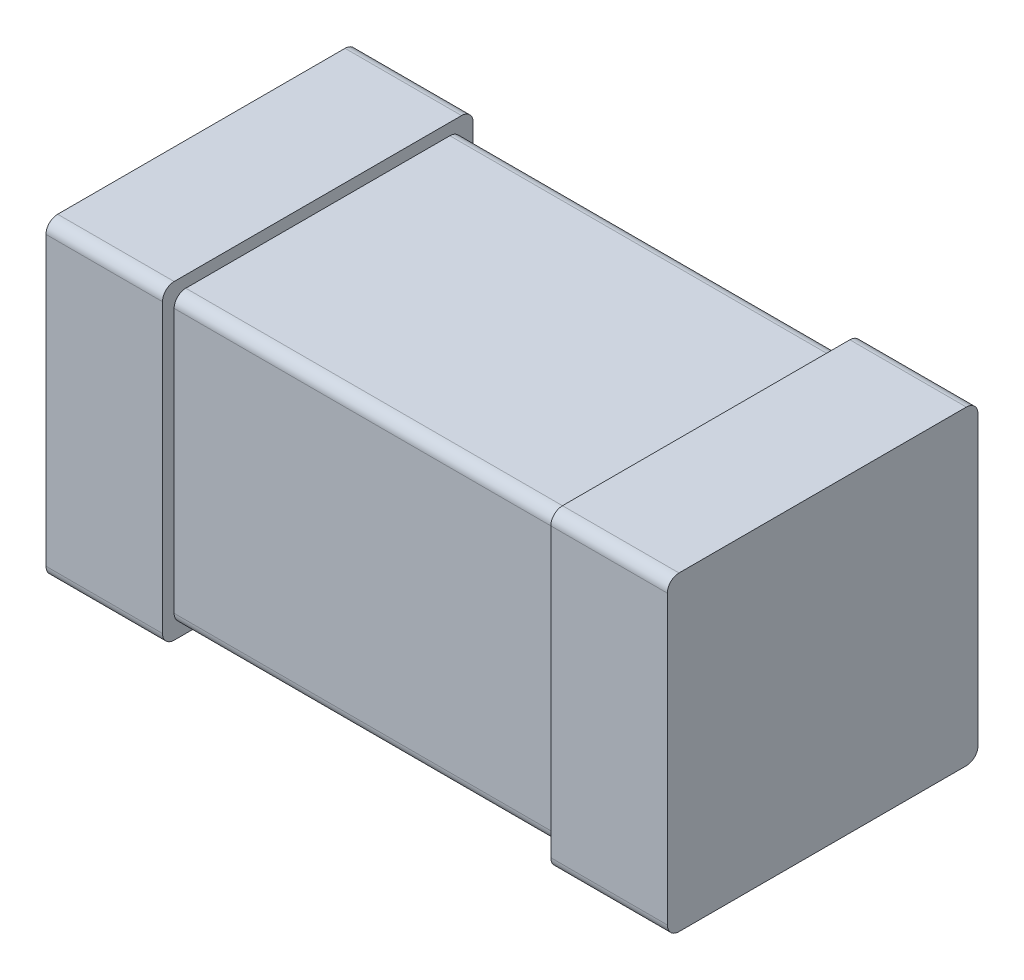
ISO-10303-21;
HEADER;
FILE_DESCRIPTION(('STEP AP214'),'2;1');
FILE_NAME('part.step','',(''),(''),'','','');
FILE_SCHEMA(('AUTOMOTIVE_DESIGN { 1 0 10303 214 1 1 1 1 }'));
ENDSEC;
DATA;
#1=APPLICATION_CONTEXT('core data for automotive mechanical design processes');
#2=APPLICATION_PROTOCOL_DEFINITION('international standard','automotive_design',2000,#1);
#3=PRODUCT_CONTEXT('',#1,'mechanical');
#4=PRODUCT('Part','Part','',(#3));
#5=PRODUCT_RELATED_PRODUCT_CATEGORY('part','',(#4));
#6=PRODUCT_DEFINITION_FORMATION('','',#4);
#7=PRODUCT_DEFINITION_CONTEXT('part definition',#1,'design');
#8=PRODUCT_DEFINITION('design','',#6,#7);
#9=PRODUCT_DEFINITION_SHAPE('','',#8);
#10=(LENGTH_UNIT() NAMED_UNIT(*) SI_UNIT(.MILLI.,.METRE.));
#11=(NAMED_UNIT(*) PLANE_ANGLE_UNIT() SI_UNIT($,.RADIAN.));
#12=(NAMED_UNIT(*) SI_UNIT($,.STERADIAN.) SOLID_ANGLE_UNIT());
#13=UNCERTAINTY_MEASURE_WITH_UNIT(LENGTH_MEASURE(1.E-05),#10,'distance_accuracy_value','');
#14=(GEOMETRIC_REPRESENTATION_CONTEXT(3) GLOBAL_UNCERTAINTY_ASSIGNED_CONTEXT((#13)) GLOBAL_UNIT_ASSIGNED_CONTEXT((#10,
#11,#12)) REPRESENTATION_CONTEXT('',''));
#15=CARTESIAN_POINT('',(0.,0.,0.));
#16=DIRECTION('',(0.,0.,1.));
#17=DIRECTION('',(1.,0.,0.));
#18=AXIS2_PLACEMENT_3D('',#15,#16,#17);
#19=CARTESIAN_POINT('',(0.8,-0.4,0.));
#20=DIRECTION('',(1.,0.,0.));
#21=DIRECTION('',(0.,1.,0.));
#22=AXIS2_PLACEMENT_3D('',#19,#20,#21);
#23=PLANE('',#22);
#24=DIRECTION('',(0.,0.,1.));
#25=VECTOR('',#24,1.);
#26=CARTESIAN_POINT('',(0.8,-0.4,0.));
#27=LINE('',#26,#25);
#28=CARTESIAN_POINT('',(0.8,-0.4,0.03));
#29=VERTEX_POINT('',#28);
#30=CARTESIAN_POINT('',(0.8,-0.4,0.77));
#31=VERTEX_POINT('',#30);
#32=EDGE_CURVE('E399',#29,#31,#27,.T.);
#33=ORIENTED_EDGE('',*,*,#32,.F.);
#34=CARTESIAN_POINT('',(0.8,-0.37,0.03));
#35=DIRECTION('',(1.,0.,0.));
#36=DIRECTION('',(0.,0.,1.));
#37=AXIS2_PLACEMENT_3D('',#34,#35,#36);
#38=CIRCLE('',#37,0.03);
#39=CARTESIAN_POINT('',(0.8,-0.37,0.));
#40=VERTEX_POINT('',#39);
#41=EDGE_CURVE('E414',#29,#40,#38,.T.);
#42=ORIENTED_EDGE('',*,*,#41,.T.);
#43=DIRECTION('',(0.,1.,0.));
#44=VECTOR('',#43,1.);
#45=CARTESIAN_POINT('',(0.8,-0.4,0.));
#46=LINE('',#45,#44);
#47=CARTESIAN_POINT('',(0.8,0.37,0.));
#48=VERTEX_POINT('',#47);
#49=EDGE_CURVE('E303',#40,#48,#46,.T.);
#50=ORIENTED_EDGE('',*,*,#49,.T.);
#51=CARTESIAN_POINT('',(0.8,0.37,0.03));
#52=DIRECTION('',(-1.,0.,0.));
#53=DIRECTION('',(0.,0.,1.));
#54=AXIS2_PLACEMENT_3D('',#51,#52,#53);
#55=CIRCLE('',#54,0.03);
#56=CARTESIAN_POINT('',(0.8,0.4,0.03));
#57=VERTEX_POINT('',#56);
#58=EDGE_CURVE('E364',#57,#48,#55,.T.);
#59=ORIENTED_EDGE('',*,*,#58,.F.);
#60=DIRECTION('',(0.,0.,1.));
#61=VECTOR('',#60,1.);
#62=CARTESIAN_POINT('',(0.8,0.4,0.));
#63=LINE('',#62,#61);
#64=CARTESIAN_POINT('',(0.8,0.4,0.77));
#65=VERTEX_POINT('',#64);
#66=EDGE_CURVE('E11',#57,#65,#63,.T.);
#67=ORIENTED_EDGE('',*,*,#66,.T.);
#68=CARTESIAN_POINT('',(0.8,0.37,0.77));
#69=DIRECTION('',(1.,0.,0.));
#70=DIRECTION('',(0.,0.,1.));
#71=AXIS2_PLACEMENT_3D('',#68,#69,#70);
#72=CIRCLE('',#71,0.03);
#73=CARTESIAN_POINT('',(0.8,0.37,0.8));
#74=VERTEX_POINT('',#73);
#75=EDGE_CURVE('E225',#65,#74,#72,.T.);
#76=ORIENTED_EDGE('',*,*,#75,.T.);
#77=DIRECTION('',(0.,1.,0.));
#78=VECTOR('',#77,1.);
#79=CARTESIAN_POINT('',(0.8,-0.4,0.8));
#80=LINE('',#79,#78);
#81=CARTESIAN_POINT('',(0.8,-0.37,0.8));
#82=VERTEX_POINT('',#81);
#83=EDGE_CURVE('E298',#82,#74,#80,.T.);
#84=ORIENTED_EDGE('',*,*,#83,.F.);
#85=CARTESIAN_POINT('',(0.8,-0.37,0.77));
#86=DIRECTION('',(-1.,0.,0.));
#87=DIRECTION('',(0.,0.,1.));
#88=AXIS2_PLACEMENT_3D('',#85,#86,#87);
#89=CIRCLE('',#88,0.03);
#90=EDGE_CURVE('E121',#31,#82,#89,.T.);
#91=ORIENTED_EDGE('',*,*,#90,.F.);
#92=EDGE_LOOP('',(#33,#42,#50,#59,#67,#76,#84,#91));
#93=FACE_BOUND('',#92,.T.);
#94=ADVANCED_FACE('F17',(#93),#23,.T.);
#95=CARTESIAN_POINT('',(0.5,0.4,0.));
#96=DIRECTION('',(0.,1.,0.));
#97=DIRECTION('',(1.,0.,0.));
#98=AXIS2_PLACEMENT_3D('',#95,#96,#97);
#99=PLANE('',#98);
#100=ORIENTED_EDGE('',*,*,#66,.F.);
#101=DIRECTION('',(1.,0.,0.));
#102=VECTOR('',#101,1.);
#103=CARTESIAN_POINT('',(0.5,0.4,0.03));
#104=LINE('',#103,#102);
#105=CARTESIAN_POINT('',(0.5,0.4,0.03));
#106=VERTEX_POINT('',#105);
#107=EDGE_CURVE('E366',#106,#57,#104,.T.);
#108=ORIENTED_EDGE('',*,*,#107,.F.);
#109=DIRECTION('',(0.,0.,1.));
#110=VECTOR('',#109,1.);
#111=CARTESIAN_POINT('',(0.5,0.4,0.));
#112=LINE('',#111,#110);
#113=CARTESIAN_POINT('',(0.5,0.4,0.77));
#114=VERTEX_POINT('',#113);
#115=EDGE_CURVE('E295',#106,#114,#112,.T.);
#116=ORIENTED_EDGE('',*,*,#115,.T.);
#117=DIRECTION('',(1.,0.,0.));
#118=VECTOR('',#117,1.);
#119=CARTESIAN_POINT('',(0.5,0.4,0.77));
#120=LINE('',#119,#118);
#121=EDGE_CURVE('E28',#114,#65,#120,.T.);
#122=ORIENTED_EDGE('',*,*,#121,.T.);
#123=EDGE_LOOP('',(#100,#108,#116,#122));
#124=FACE_BOUND('',#123,.T.);
#125=ADVANCED_FACE('F449',(#124),#99,.T.);
#126=CARTESIAN_POINT('',(0.5,0.37,0.77));
#127=DIRECTION('',(1.,0.,0.));
#128=DIRECTION('',(0.,1.,0.));
#129=AXIS2_PLACEMENT_3D('',#126,#127,#128);
#130=CYLINDRICAL_SURFACE('',#129,0.03);
#131=CARTESIAN_POINT('',(0.5,0.37,0.77));
#132=DIRECTION('',(1.,0.,0.));
#133=DIRECTION('',(0.,0.,1.));
#134=AXIS2_PLACEMENT_3D('',#131,#132,#133);
#135=CIRCLE('',#134,0.03);
#136=CARTESIAN_POINT('',(0.5,0.37,0.8));
#137=VERTEX_POINT('',#136);
#138=EDGE_CURVE('E285',#114,#137,#135,.T.);
#139=ORIENTED_EDGE('',*,*,#138,.T.);
#140=DIRECTION('',(1.,0.,0.));
#141=VECTOR('',#140,1.);
#142=CARTESIAN_POINT('',(0.5,0.37,0.8));
#143=LINE('',#142,#141);
#144=EDGE_CURVE('E302',#137,#74,#143,.T.);
#145=ORIENTED_EDGE('',*,*,#144,.T.);
#146=ORIENTED_EDGE('',*,*,#75,.F.);
#147=ORIENTED_EDGE('',*,*,#121,.F.);
#148=EDGE_LOOP('',(#139,#145,#146,#147));
#149=FACE_BOUND('',#148,.T.);
#150=ADVANCED_FACE('F457',(#149),#130,.T.);
#151=CARTESIAN_POINT('',(0.5,0.37,0.03));
#152=DIRECTION('',(1.,0.,0.));
#153=DIRECTION('',(0.,1.,0.));
#154=AXIS2_PLACEMENT_3D('',#151,#152,#153);
#155=CYLINDRICAL_SURFACE('',#154,0.03);
#156=ORIENTED_EDGE('',*,*,#107,.T.);
#157=ORIENTED_EDGE('',*,*,#58,.T.);
#158=DIRECTION('',(1.,0.,0.));
#159=VECTOR('',#158,1.);
#160=CARTESIAN_POINT('',(0.5,0.37,0.));
#161=LINE('',#160,#159);
#162=CARTESIAN_POINT('',(0.5,0.37,0.));
#163=VERTEX_POINT('',#162);
#164=EDGE_CURVE('E392',#163,#48,#161,.T.);
#165=ORIENTED_EDGE('',*,*,#164,.F.);
#166=CARTESIAN_POINT('',(0.5,0.37,0.03));
#167=DIRECTION('',(-1.,0.,0.));
#168=DIRECTION('',(0.,0.,1.));
#169=AXIS2_PLACEMENT_3D('',#166,#167,#168);
#170=CIRCLE('',#169,0.03);
#171=EDGE_CURVE('E291',#106,#163,#170,.T.);
#172=ORIENTED_EDGE('',*,*,#171,.F.);
#173=EDGE_LOOP('',(#156,#157,#165,#172));
#174=FACE_BOUND('',#173,.T.);
#175=ADVANCED_FACE('F610',(#174),#155,.T.);
#176=CARTESIAN_POINT('',(0.5,-0.4,0.8));
#177=DIRECTION('',(0.,0.,1.));
#178=DIRECTION('',(1.,0.,0.));
#179=AXIS2_PLACEMENT_3D('',#176,#177,#178);
#180=PLANE('',#179);
#181=DIRECTION('',(0.,1.,0.));
#182=VECTOR('',#181,1.);
#183=CARTESIAN_POINT('',(0.5,-0.4,0.8));
#184=LINE('',#183,#182);
#185=CARTESIAN_POINT('',(0.5,-0.37,0.8));
#186=VERTEX_POINT('',#185);
#187=EDGE_CURVE('E281',#186,#137,#184,.T.);
#188=ORIENTED_EDGE('',*,*,#187,.F.);
#189=DIRECTION('',(1.,0.,0.));
#190=VECTOR('',#189,1.);
#191=CARTESIAN_POINT('',(0.5,-0.37,0.8));
#192=LINE('',#191,#190);
#193=EDGE_CURVE('E396',#186,#82,#192,.T.);
#194=ORIENTED_EDGE('',*,*,#193,.T.);
#195=ORIENTED_EDGE('',*,*,#83,.T.);
#196=ORIENTED_EDGE('',*,*,#144,.F.);
#197=EDGE_LOOP('',(#188,#194,#195,#196));
#198=FACE_BOUND('',#197,.T.);
#199=ADVANCED_FACE('F460',(#198),#180,.T.);
#200=CARTESIAN_POINT('',(0.5,-0.4,0.));
#201=DIRECTION('',(0.,0.,1.));
#202=DIRECTION('',(1.,0.,0.));
#203=AXIS2_PLACEMENT_3D('',#200,#201,#202);
#204=PLANE('',#203);
#205=ORIENTED_EDGE('',*,*,#164,.T.);
#206=ORIENTED_EDGE('',*,*,#49,.F.);
#207=DIRECTION('',(1.,0.,0.));
#208=VECTOR('',#207,1.);
#209=CARTESIAN_POINT('',(0.5,-0.37,0.));
#210=LINE('',#209,#208);
#211=CARTESIAN_POINT('',(0.5,-0.37,0.));
#212=VERTEX_POINT('',#211);
#213=EDGE_CURVE('E418',#212,#40,#210,.T.);
#214=ORIENTED_EDGE('',*,*,#213,.F.);
#215=DIRECTION('',(0.,1.,0.));
#216=VECTOR('',#215,1.);
#217=CARTESIAN_POINT('',(0.5,-0.4,0.));
#218=LINE('',#217,#216);
#219=EDGE_CURVE('E248',#212,#163,#218,.T.);
#220=ORIENTED_EDGE('',*,*,#219,.T.);
#221=EDGE_LOOP('',(#205,#206,#214,#220));
#222=FACE_BOUND('',#221,.T.);
#223=ADVANCED_FACE('F474',(#222),#204,.F.);
#224=CARTESIAN_POINT('',(0.5,-0.37,0.77));
#225=DIRECTION('',(1.,0.,0.));
#226=DIRECTION('',(0.,-1.,0.));
#227=AXIS2_PLACEMENT_3D('',#224,#225,#226);
#228=CYLINDRICAL_SURFACE('',#227,0.03);
#229=DIRECTION('',(1.,0.,0.));
#230=VECTOR('',#229,1.);
#231=CARTESIAN_POINT('',(0.5,-0.4,0.77));
#232=LINE('',#231,#230);
#233=CARTESIAN_POINT('',(0.5,-0.4,0.77));
#234=VERTEX_POINT('',#233);
#235=EDGE_CURVE('E400',#234,#31,#232,.T.);
#236=ORIENTED_EDGE('',*,*,#235,.T.);
#237=ORIENTED_EDGE('',*,*,#90,.T.);
#238=ORIENTED_EDGE('',*,*,#193,.F.);
#239=CARTESIAN_POINT('',(0.5,-0.37,0.77));
#240=DIRECTION('',(-1.,0.,0.));
#241=DIRECTION('',(0.,0.,1.));
#242=AXIS2_PLACEMENT_3D('',#239,#240,#241);
#243=CIRCLE('',#242,0.03);
#244=EDGE_CURVE('E286',#234,#186,#243,.T.);
#245=ORIENTED_EDGE('',*,*,#244,.F.);
#246=EDGE_LOOP('',(#236,#237,#238,#245));
#247=FACE_BOUND('',#246,.T.);
#248=ADVANCED_FACE('F463',(#247),#228,.T.);
#249=CARTESIAN_POINT('',(0.5,-0.37,0.03));
#250=DIRECTION('',(1.,0.,0.));
#251=DIRECTION('',(0.,-1.,0.));
#252=AXIS2_PLACEMENT_3D('',#249,#250,#251);
#253=CYLINDRICAL_SURFACE('',#252,0.03);
#254=CARTESIAN_POINT('',(0.5,-0.37,0.03));
#255=DIRECTION('',(1.,0.,0.));
#256=DIRECTION('',(0.,0.,1.));
#257=AXIS2_PLACEMENT_3D('',#254,#255,#256);
#258=CIRCLE('',#257,0.03);
#259=CARTESIAN_POINT('',(0.5,-0.4,0.03));
#260=VERTEX_POINT('',#259);
#261=EDGE_CURVE('E244',#260,#212,#258,.T.);
#262=ORIENTED_EDGE('',*,*,#261,.T.);
#263=ORIENTED_EDGE('',*,*,#213,.T.);
#264=ORIENTED_EDGE('',*,*,#41,.F.);
#265=DIRECTION('',(1.,0.,0.));
#266=VECTOR('',#265,1.);
#267=CARTESIAN_POINT('',(0.5,-0.4,0.03));
#268=LINE('',#267,#266);
#269=EDGE_CURVE('E132',#260,#29,#268,.T.);
#270=ORIENTED_EDGE('',*,*,#269,.F.);
#271=EDGE_LOOP('',(#262,#263,#264,#270));
#272=FACE_BOUND('',#271,.T.);
#273=ADVANCED_FACE('F472',(#272),#253,.T.);
#274=CARTESIAN_POINT('',(0.5,-0.4,0.));
#275=DIRECTION('',(0.,1.,0.));
#276=DIRECTION('',(1.,0.,0.));
#277=AXIS2_PLACEMENT_3D('',#274,#275,#276);
#278=PLANE('',#277);
#279=ORIENTED_EDGE('',*,*,#235,.F.);
#280=DIRECTION('',(0.,0.,1.));
#281=VECTOR('',#280,1.);
#282=CARTESIAN_POINT('',(0.5,-0.4,0.));
#283=LINE('',#282,#281);
#284=EDGE_CURVE('E247',#260,#234,#283,.T.);
#285=ORIENTED_EDGE('',*,*,#284,.F.);
#286=ORIENTED_EDGE('',*,*,#269,.T.);
#287=ORIENTED_EDGE('',*,*,#32,.T.);
#288=EDGE_LOOP('',(#279,#285,#286,#287));
#289=FACE_BOUND('',#288,.T.);
#290=ADVANCED_FACE('F467',(#289),#278,.F.);
#291=CARTESIAN_POINT('',(0.5,-0.4,0.));
#292=DIRECTION('',(1.,0.,0.));
#293=DIRECTION('',(0.,1.,0.));
#294=AXIS2_PLACEMENT_3D('',#291,#292,#293);
#295=PLANE('',#294);
#296=DIRECTION('',(0.,1.,0.));
#297=VECTOR('',#296,1.);
#298=CARTESIAN_POINT('',(0.5,-0.37,0.03));
#299=LINE('',#298,#297);
#300=CARTESIAN_POINT('',(0.5,-0.34,0.03));
#301=VERTEX_POINT('',#300);
#302=CARTESIAN_POINT('',(0.5,0.34,0.03));
#303=VERTEX_POINT('',#302);
#304=EDGE_CURVE('E232',#301,#303,#299,.T.);
#305=ORIENTED_EDGE('',*,*,#304,.T.);
#306=CARTESIAN_POINT('',(0.5,0.34,0.06));
#307=DIRECTION('',(-1.,0.,0.));
#308=DIRECTION('',(0.,0.,1.));
#309=AXIS2_PLACEMENT_3D('',#306,#307,#308);
#310=CIRCLE('',#309,0.03);
#311=CARTESIAN_POINT('',(0.5,0.37,0.06));
#312=VERTEX_POINT('',#311);
#313=EDGE_CURVE('E243',#312,#303,#310,.T.);
#314=ORIENTED_EDGE('',*,*,#313,.F.);
#315=DIRECTION('',(0.,0.,1.));
#316=VECTOR('',#315,1.);
#317=CARTESIAN_POINT('',(0.5,0.37,0.03));
#318=LINE('',#317,#316);
#319=CARTESIAN_POINT('',(0.5,0.37,0.74));
#320=VERTEX_POINT('',#319);
#321=EDGE_CURVE('E238',#312,#320,#318,.T.);
#322=ORIENTED_EDGE('',*,*,#321,.T.);
#323=CARTESIAN_POINT('',(0.5,0.34,0.74));
#324=DIRECTION('',(1.,0.,0.));
#325=DIRECTION('',(0.,0.,1.));
#326=AXIS2_PLACEMENT_3D('',#323,#324,#325);
#327=CIRCLE('',#326,0.03);
#328=CARTESIAN_POINT('',(0.5,0.34,0.77));
#329=VERTEX_POINT('',#328);
#330=EDGE_CURVE('E308',#320,#329,#327,.T.);
#331=ORIENTED_EDGE('',*,*,#330,.T.);
#332=DIRECTION('',(0.,1.,0.));
#333=VECTOR('',#332,1.);
#334=CARTESIAN_POINT('',(0.5,-0.37,0.77));
#335=LINE('',#334,#333);
#336=CARTESIAN_POINT('',(0.5,-0.34,0.77));
#337=VERTEX_POINT('',#336);
#338=EDGE_CURVE('E333',#337,#329,#335,.T.);
#339=ORIENTED_EDGE('',*,*,#338,.F.);
#340=CARTESIAN_POINT('',(0.5,-0.34,0.74));
#341=DIRECTION('',(-1.,0.,0.));
#342=DIRECTION('',(0.,0.,1.));
#343=AXIS2_PLACEMENT_3D('',#340,#341,#342);
#344=CIRCLE('',#343,0.03);
#345=CARTESIAN_POINT('',(0.5,-0.37,0.74));
#346=VERTEX_POINT('',#345);
#347=EDGE_CURVE('E332',#346,#337,#344,.T.);
#348=ORIENTED_EDGE('',*,*,#347,.F.);
#349=DIRECTION('',(0.,0.,1.));
#350=VECTOR('',#349,1.);
#351=CARTESIAN_POINT('',(0.5,-0.37,0.03));
#352=LINE('',#351,#350);
#353=CARTESIAN_POINT('',(0.5,-0.37,0.06));
#354=VERTEX_POINT('',#353);
#355=EDGE_CURVE('E290',#354,#346,#352,.T.);
#356=ORIENTED_EDGE('',*,*,#355,.F.);
#357=CARTESIAN_POINT('',(0.5,-0.34,0.06));
#358=DIRECTION('',(1.,0.,0.));
#359=DIRECTION('',(0.,0.,1.));
#360=AXIS2_PLACEMENT_3D('',#357,#358,#359);
#361=CIRCLE('',#360,0.03);
#362=EDGE_CURVE('E341',#354,#301,#361,.T.);
#363=ORIENTED_EDGE('',*,*,#362,.T.);
#364=EDGE_LOOP('',(#305,#314,#322,#331,#339,#348,#356,#363));
#365=FACE_BOUND('',#364,.T.);
#366=ORIENTED_EDGE('',*,*,#244,.T.);
#367=ORIENTED_EDGE('',*,*,#187,.T.);
#368=ORIENTED_EDGE('',*,*,#138,.F.);
#369=ORIENTED_EDGE('',*,*,#115,.F.);
#370=ORIENTED_EDGE('',*,*,#171,.T.);
#371=ORIENTED_EDGE('',*,*,#219,.F.);
#372=ORIENTED_EDGE('',*,*,#261,.F.);
#373=ORIENTED_EDGE('',*,*,#284,.T.);
#374=EDGE_LOOP('',(#366,#367,#368,#369,#370,#371,#372,#373));
#375=FACE_BOUND('',#374,.T.);
#376=ADVANCED_FACE('F454',(#365,#375),#295,.F.);
#377=CARTESIAN_POINT('',(-0.5,-0.37,0.03));
#378=DIRECTION('',(0.,1.,0.));
#379=DIRECTION('',(1.,0.,0.));
#380=AXIS2_PLACEMENT_3D('',#377,#378,#379);
#381=PLANE('',#380);
#382=DIRECTION('',(1.,0.,0.));
#383=VECTOR('',#382,1.);
#384=CARTESIAN_POINT('',(-0.5,-0.37,0.74));
#385=LINE('',#384,#383);
#386=CARTESIAN_POINT('',(-0.5,-0.37,0.74));
#387=VERTEX_POINT('',#386);
#388=EDGE_CURVE('E328',#387,#346,#385,.T.);
#389=ORIENTED_EDGE('',*,*,#388,.F.);
#390=DIRECTION('',(0.,0.,1.));
#391=VECTOR('',#390,1.);
#392=CARTESIAN_POINT('',(-0.5,-0.37,0.03));
#393=LINE('',#392,#391);
#394=CARTESIAN_POINT('',(-0.5,-0.37,0.06));
#395=VERTEX_POINT('',#394);
#396=EDGE_CURVE('E264',#395,#387,#393,.T.);
#397=ORIENTED_EDGE('',*,*,#396,.F.);
#398=DIRECTION('',(1.,0.,0.));
#399=VECTOR('',#398,1.);
#400=CARTESIAN_POINT('',(-0.5,-0.37,0.06));
#401=LINE('',#400,#399);
#402=EDGE_CURVE('E280',#395,#354,#401,.T.);
#403=ORIENTED_EDGE('',*,*,#402,.T.);
#404=ORIENTED_EDGE('',*,*,#355,.T.);
#405=EDGE_LOOP('',(#389,#397,#403,#404));
#406=FACE_BOUND('',#405,.T.);
#407=ADVANCED_FACE('F513',(#406),#381,.F.);
#408=CARTESIAN_POINT('',(-0.5,-0.34,0.74));
#409=DIRECTION('',(1.,0.,0.));
#410=DIRECTION('',(0.,-1.,0.));
#411=AXIS2_PLACEMENT_3D('',#408,#409,#410);
#412=CYLINDRICAL_SURFACE('',#411,0.03);
#413=ORIENTED_EDGE('',*,*,#388,.T.);
#414=ORIENTED_EDGE('',*,*,#347,.T.);
#415=DIRECTION('',(1.,0.,0.));
#416=VECTOR('',#415,1.);
#417=CARTESIAN_POINT('',(-0.5,-0.34,0.77));
#418=LINE('',#417,#416);
#419=CARTESIAN_POINT('',(-0.5,-0.34,0.77));
#420=VERTEX_POINT('',#419);
#421=EDGE_CURVE('E424',#420,#337,#418,.T.);
#422=ORIENTED_EDGE('',*,*,#421,.F.);
#423=CARTESIAN_POINT('',(-0.5,-0.34,0.74));
#424=DIRECTION('',(-1.,0.,0.));
#425=DIRECTION('',(0.,0.,1.));
#426=AXIS2_PLACEMENT_3D('',#423,#424,#425);
#427=CIRCLE('',#426,0.03);
#428=EDGE_CURVE('E268',#387,#420,#427,.T.);
#429=ORIENTED_EDGE('',*,*,#428,.F.);
#430=EDGE_LOOP('',(#413,#414,#422,#429));
#431=FACE_BOUND('',#430,.T.);
#432=ADVANCED_FACE('F496',(#431),#412,.T.);
#433=CARTESIAN_POINT('',(-0.5,-0.37,0.77));
#434=DIRECTION('',(0.,0.,1.));
#435=DIRECTION('',(1.,0.,0.));
#436=AXIS2_PLACEMENT_3D('',#433,#434,#435);
#437=PLANE('',#436);
#438=DIRECTION('',(0.,1.,0.));
#439=VECTOR('',#438,1.);
#440=CARTESIAN_POINT('',(-0.5,-0.37,0.77));
#441=LINE('',#440,#439);
#442=CARTESIAN_POINT('',(-0.5,0.34,0.77));
#443=VERTEX_POINT('',#442);
#444=EDGE_CURVE('E21',#420,#443,#441,.T.);
#445=ORIENTED_EDGE('',*,*,#444,.F.);
#446=ORIENTED_EDGE('',*,*,#421,.T.);
#447=ORIENTED_EDGE('',*,*,#338,.T.);
#448=DIRECTION('',(1.,0.,0.));
#449=VECTOR('',#448,1.);
#450=CARTESIAN_POINT('',(-0.5,0.34,0.77));
#451=LINE('',#450,#449);
#452=EDGE_CURVE('E304',#443,#329,#451,.T.);
#453=ORIENTED_EDGE('',*,*,#452,.F.);
#454=EDGE_LOOP('',(#445,#446,#447,#453));
#455=FACE_BOUND('',#454,.T.);
#456=ADVANCED_FACE('F503',(#455),#437,.T.);
#457=CARTESIAN_POINT('',(-0.5,0.34,0.74));
#458=DIRECTION('',(1.,0.,0.));
#459=DIRECTION('',(0.,1.,0.));
#460=AXIS2_PLACEMENT_3D('',#457,#458,#459);
#461=CYLINDRICAL_SURFACE('',#460,0.03);
#462=CARTESIAN_POINT('',(-0.5,0.34,0.74));
#463=DIRECTION('',(1.,0.,0.));
#464=DIRECTION('',(0.,0.,1.));
#465=AXIS2_PLACEMENT_3D('',#462,#463,#464);
#466=CIRCLE('',#465,0.03);
#467=CARTESIAN_POINT('',(-0.5,0.37,0.74));
#468=VERTEX_POINT('',#467);
#469=EDGE_CURVE('E406',#468,#443,#466,.T.);
#470=ORIENTED_EDGE('',*,*,#469,.T.);
#471=ORIENTED_EDGE('',*,*,#452,.T.);
#472=ORIENTED_EDGE('',*,*,#330,.F.);
#473=DIRECTION('',(1.,0.,0.));
#474=VECTOR('',#473,1.);
#475=CARTESIAN_POINT('',(-0.5,0.37,0.74));
#476=LINE('',#475,#474);
#477=EDGE_CURVE('E242',#468,#320,#476,.T.);
#478=ORIENTED_EDGE('',*,*,#477,.F.);
#479=EDGE_LOOP('',(#470,#471,#472,#478));
#480=FACE_BOUND('',#479,.T.);
#481=ADVANCED_FACE('F630',(#480),#461,.T.);
#482=CARTESIAN_POINT('',(-0.5,0.37,0.03));
#483=DIRECTION('',(0.,1.,0.));
#484=DIRECTION('',(1.,0.,0.));
#485=AXIS2_PLACEMENT_3D('',#482,#483,#484);
#486=PLANE('',#485);
#487=ORIENTED_EDGE('',*,*,#321,.F.);
#488=DIRECTION('',(1.,0.,0.));
#489=VECTOR('',#488,1.);
#490=CARTESIAN_POINT('',(-0.5,0.37,0.06));
#491=LINE('',#490,#489);
#492=CARTESIAN_POINT('',(-0.5,0.37,0.06));
#493=VERTEX_POINT('',#492);
#494=EDGE_CURVE('E236',#493,#312,#491,.T.);
#495=ORIENTED_EDGE('',*,*,#494,.F.);
#496=DIRECTION('',(0.,0.,1.));
#497=VECTOR('',#496,1.);
#498=CARTESIAN_POINT('',(-0.5,0.37,0.03));
#499=LINE('',#498,#497);
#500=EDGE_CURVE('E410',#493,#468,#499,.T.);
#501=ORIENTED_EDGE('',*,*,#500,.T.);
#502=ORIENTED_EDGE('',*,*,#477,.T.);
#503=EDGE_LOOP('',(#487,#495,#501,#502));
#504=FACE_BOUND('',#503,.T.);
#505=ADVANCED_FACE('F553',(#504),#486,.T.);
#506=CARTESIAN_POINT('',(-0.5,0.34,0.06));
#507=DIRECTION('',(1.,0.,0.));
#508=DIRECTION('',(0.,1.,0.));
#509=AXIS2_PLACEMENT_3D('',#506,#507,#508);
#510=CYLINDRICAL_SURFACE('',#509,0.03);
#511=ORIENTED_EDGE('',*,*,#494,.T.);
#512=ORIENTED_EDGE('',*,*,#313,.T.);
#513=DIRECTION('',(1.,0.,0.));
#514=VECTOR('',#513,1.);
#515=CARTESIAN_POINT('',(-0.5,0.34,0.03));
#516=LINE('',#515,#514);
#517=CARTESIAN_POINT('',(-0.5,0.34,0.03));
#518=VERTEX_POINT('',#517);
#519=EDGE_CURVE('E237',#518,#303,#516,.T.);
#520=ORIENTED_EDGE('',*,*,#519,.F.);
#521=CARTESIAN_POINT('',(-0.5,0.34,0.06));
#522=DIRECTION('',(-1.,0.,0.));
#523=DIRECTION('',(0.,0.,1.));
#524=AXIS2_PLACEMENT_3D('',#521,#522,#523);
#525=CIRCLE('',#524,0.03);
#526=EDGE_CURVE('E430',#493,#518,#525,.T.);
#527=ORIENTED_EDGE('',*,*,#526,.F.);
#528=EDGE_LOOP('',(#511,#512,#520,#527));
#529=FACE_BOUND('',#528,.T.);
#530=ADVANCED_FACE('F557',(#529),#510,.T.);
#531=CARTESIAN_POINT('',(-0.5,-0.37,0.03));
#532=DIRECTION('',(0.,0.,1.));
#533=DIRECTION('',(1.,0.,0.));
#534=AXIS2_PLACEMENT_3D('',#531,#532,#533);
#535=PLANE('',#534);
#536=ORIENTED_EDGE('',*,*,#519,.T.);
#537=ORIENTED_EDGE('',*,*,#304,.F.);
#538=DIRECTION('',(1.,0.,0.));
#539=VECTOR('',#538,1.);
#540=CARTESIAN_POINT('',(-0.5,-0.34,0.03));
#541=LINE('',#540,#539);
#542=CARTESIAN_POINT('',(-0.5,-0.34,0.03));
#543=VERTEX_POINT('',#542);
#544=EDGE_CURVE('E337',#543,#301,#541,.T.);
#545=ORIENTED_EDGE('',*,*,#544,.F.);
#546=DIRECTION('',(0.,1.,0.));
#547=VECTOR('',#546,1.);
#548=CARTESIAN_POINT('',(-0.5,-0.37,0.03));
#549=LINE('',#548,#547);
#550=EDGE_CURVE('E342',#543,#518,#549,.T.);
#551=ORIENTED_EDGE('',*,*,#550,.T.);
#552=EDGE_LOOP('',(#536,#537,#545,#551));
#553=FACE_BOUND('',#552,.T.);
#554=ADVANCED_FACE('F621',(#553),#535,.F.);
#555=CARTESIAN_POINT('',(-0.5,-0.34,0.06));
#556=DIRECTION('',(1.,0.,0.));
#557=DIRECTION('',(0.,-1.,0.));
#558=AXIS2_PLACEMENT_3D('',#555,#556,#557);
#559=CYLINDRICAL_SURFACE('',#558,0.03);
#560=CARTESIAN_POINT('',(-0.5,-0.34,0.06));
#561=DIRECTION('',(1.,0.,0.));
#562=DIRECTION('',(0.,0.,1.));
#563=AXIS2_PLACEMENT_3D('',#560,#561,#562);
#564=CIRCLE('',#563,0.03);
#565=EDGE_CURVE('E258',#395,#543,#564,.T.);
#566=ORIENTED_EDGE('',*,*,#565,.T.);
#567=ORIENTED_EDGE('',*,*,#544,.T.);
#568=ORIENTED_EDGE('',*,*,#362,.F.);
#569=ORIENTED_EDGE('',*,*,#402,.F.);
#570=EDGE_LOOP('',(#566,#567,#568,#569));
#571=FACE_BOUND('',#570,.T.);
#572=ADVANCED_FACE('F628',(#571),#559,.T.);
#573=CARTESIAN_POINT('',(-0.5,-0.4,0.));
#574=DIRECTION('',(1.,0.,0.));
#575=DIRECTION('',(0.,1.,0.));
#576=AXIS2_PLACEMENT_3D('',#573,#574,#575);
#577=PLANE('',#576);
#578=ORIENTED_EDGE('',*,*,#565,.F.);
#579=ORIENTED_EDGE('',*,*,#396,.T.);
#580=ORIENTED_EDGE('',*,*,#428,.T.);
#581=ORIENTED_EDGE('',*,*,#444,.T.);
#582=ORIENTED_EDGE('',*,*,#469,.F.);
#583=ORIENTED_EDGE('',*,*,#500,.F.);
#584=ORIENTED_EDGE('',*,*,#526,.T.);
#585=ORIENTED_EDGE('',*,*,#550,.F.);
#586=EDGE_LOOP('',(#578,#579,#580,#581,#582,#583,#584,#585));
#587=FACE_BOUND('',#586,.T.);
#588=DIRECTION('',(0.,0.,1.));
#589=VECTOR('',#588,1.);
#590=CARTESIAN_POINT('',(-0.5,-0.4,0.));
#591=LINE('',#590,#589);
#592=CARTESIAN_POINT('',(-0.5,-0.4,0.03));
#593=VERTEX_POINT('',#592);
#594=CARTESIAN_POINT('',(-0.5,-0.4,0.77));
#595=VERTEX_POINT('',#594);
#596=EDGE_CURVE('E202',#593,#595,#591,.T.);
#597=ORIENTED_EDGE('',*,*,#596,.F.);
#598=CARTESIAN_POINT('',(-0.5,-0.37,0.03));
#599=DIRECTION('',(1.,0.,0.));
#600=DIRECTION('',(0.,0.,1.));
#601=AXIS2_PLACEMENT_3D('',#598,#599,#600);
#602=CIRCLE('',#601,0.03);
#603=CARTESIAN_POINT('',(-0.5,-0.37,0.));
#604=VERTEX_POINT('',#603);
#605=EDGE_CURVE('E188',#593,#604,#602,.T.);
#606=ORIENTED_EDGE('',*,*,#605,.T.);
#607=DIRECTION('',(0.,1.,0.));
#608=VECTOR('',#607,1.);
#609=CARTESIAN_POINT('',(-0.5,-0.4,0.));
#610=LINE('',#609,#608);
#611=CARTESIAN_POINT('',(-0.5,0.37,0.));
#612=VERTEX_POINT('',#611);
#613=EDGE_CURVE('E386',#604,#612,#610,.T.);
#614=ORIENTED_EDGE('',*,*,#613,.T.);
#615=CARTESIAN_POINT('',(-0.5,0.37,0.03));
#616=DIRECTION('',(-1.,0.,0.));
#617=DIRECTION('',(0.,0.,1.));
#618=AXIS2_PLACEMENT_3D('',#615,#616,#617);
#619=CIRCLE('',#618,0.03);
#620=CARTESIAN_POINT('',(-0.5,0.4,0.03));
#621=VERTEX_POINT('',#620);
#622=EDGE_CURVE('E353',#621,#612,#619,.T.);
#623=ORIENTED_EDGE('',*,*,#622,.F.);
#624=DIRECTION('',(0.,0.,1.));
#625=VECTOR('',#624,1.);
#626=CARTESIAN_POINT('',(-0.5,0.4,0.));
#627=LINE('',#626,#625);
#628=CARTESIAN_POINT('',(-0.5,0.4,0.77));
#629=VERTEX_POINT('',#628);
#630=EDGE_CURVE('E255',#621,#629,#627,.T.);
#631=ORIENTED_EDGE('',*,*,#630,.T.);
#632=CARTESIAN_POINT('',(-0.5,0.37,0.77));
#633=DIRECTION('',(1.,0.,0.));
#634=DIRECTION('',(0.,0.,1.));
#635=AXIS2_PLACEMENT_3D('',#632,#633,#634);
#636=CIRCLE('',#635,0.03);
#637=CARTESIAN_POINT('',(-0.5,0.37,0.8));
#638=VERTEX_POINT('',#637);
#639=EDGE_CURVE('E276',#629,#638,#636,.T.);
#640=ORIENTED_EDGE('',*,*,#639,.T.);
#641=DIRECTION('',(0.,1.,0.));
#642=VECTOR('',#641,1.);
#643=CARTESIAN_POINT('',(-0.5,-0.4,0.8));
#644=LINE('',#643,#642);
#645=CARTESIAN_POINT('',(-0.5,-0.37,0.8));
#646=VERTEX_POINT('',#645);
#647=EDGE_CURVE('E322',#646,#638,#644,.T.);
#648=ORIENTED_EDGE('',*,*,#647,.F.);
#649=CARTESIAN_POINT('',(-0.5,-0.37,0.77));
#650=DIRECTION('',(-1.,0.,0.));
#651=DIRECTION('',(0.,0.,1.));
#652=AXIS2_PLACEMENT_3D('',#649,#650,#651);
#653=CIRCLE('',#652,0.03);
#654=EDGE_CURVE('E199',#595,#646,#653,.T.);
#655=ORIENTED_EDGE('',*,*,#654,.F.);
#656=EDGE_LOOP('',(#597,#606,#614,#623,#631,#640,#648,#655));
#657=FACE_BOUND('',#656,.T.);
#658=ADVANCED_FACE('F203',(#587,#657),#577,.T.);
#659=CARTESIAN_POINT('',(-0.8,0.4,0.));
#660=DIRECTION('',(0.,1.,0.));
#661=DIRECTION('',(1.,0.,0.));
#662=AXIS2_PLACEMENT_3D('',#659,#660,#661);
#663=PLANE('',#662);
#664=ORIENTED_EDGE('',*,*,#630,.F.);
#665=DIRECTION('',(1.,0.,0.));
#666=VECTOR('',#665,1.);
#667=CARTESIAN_POINT('',(-0.8,0.4,0.03));
#668=LINE('',#667,#666);
#669=CARTESIAN_POINT('',(-0.8,0.4,0.03));
#670=VERTEX_POINT('',#669);
#671=EDGE_CURVE('E321',#670,#621,#668,.T.);
#672=ORIENTED_EDGE('',*,*,#671,.F.);
#673=DIRECTION('',(0.,0.,1.));
#674=VECTOR('',#673,1.);
#675=CARTESIAN_POINT('',(-0.8,0.4,0.));
#676=LINE('',#675,#674);
#677=CARTESIAN_POINT('',(-0.8,0.4,0.77));
#678=VERTEX_POINT('',#677);
#679=EDGE_CURVE('E272',#670,#678,#676,.T.);
#680=ORIENTED_EDGE('',*,*,#679,.T.);
#681=DIRECTION('',(1.,0.,0.));
#682=VECTOR('',#681,1.);
#683=CARTESIAN_POINT('',(-0.8,0.4,0.77));
#684=LINE('',#683,#682);
#685=EDGE_CURVE('E259',#678,#629,#684,.T.);
#686=ORIENTED_EDGE('',*,*,#685,.T.);
#687=EDGE_LOOP('',(#664,#672,#680,#686));
#688=FACE_BOUND('',#687,.T.);
#689=ADVANCED_FACE('F584',(#688),#663,.T.);
#690=CARTESIAN_POINT('',(-0.8,0.37,0.77));
#691=DIRECTION('',(1.,0.,0.));
#692=DIRECTION('',(0.,1.,0.));
#693=AXIS2_PLACEMENT_3D('',#690,#691,#692);
#694=CYLINDRICAL_SURFACE('',#693,0.03);
#695=CARTESIAN_POINT('',(-0.8,0.37,0.77));
#696=DIRECTION('',(1.,0.,0.));
#697=DIRECTION('',(0.,0.,1.));
#698=AXIS2_PLACEMENT_3D('',#695,#696,#697);
#699=CIRCLE('',#698,0.03);
#700=CARTESIAN_POINT('',(-0.8,0.37,0.8));
#701=VERTEX_POINT('',#700);
#702=EDGE_CURVE('E230',#678,#701,#699,.T.);
#703=ORIENTED_EDGE('',*,*,#702,.T.);
#704=DIRECTION('',(1.,0.,0.));
#705=VECTOR('',#704,1.);
#706=CARTESIAN_POINT('',(-0.8,0.37,0.8));
#707=LINE('',#706,#705);
#708=EDGE_CURVE('E317',#701,#638,#707,.T.);
#709=ORIENTED_EDGE('',*,*,#708,.T.);
#710=ORIENTED_EDGE('',*,*,#639,.F.);
#711=ORIENTED_EDGE('',*,*,#685,.F.);
#712=EDGE_LOOP('',(#703,#709,#710,#711));
#713=FACE_BOUND('',#712,.T.);
#714=ADVANCED_FACE('F579',(#713),#694,.T.);
#715=CARTESIAN_POINT('',(-0.8,0.37,0.03));
#716=DIRECTION('',(1.,0.,0.));
#717=DIRECTION('',(0.,1.,0.));
#718=AXIS2_PLACEMENT_3D('',#715,#716,#717);
#719=CYLINDRICAL_SURFACE('',#718,0.03);
#720=ORIENTED_EDGE('',*,*,#671,.T.);
#721=ORIENTED_EDGE('',*,*,#622,.T.);
#722=DIRECTION('',(1.,0.,0.));
#723=VECTOR('',#722,1.);
#724=CARTESIAN_POINT('',(-0.8,0.37,0.));
#725=LINE('',#724,#723);
#726=CARTESIAN_POINT('',(-0.8,0.37,0.));
#727=VERTEX_POINT('',#726);
#728=EDGE_CURVE('E313',#727,#612,#725,.T.);
#729=ORIENTED_EDGE('',*,*,#728,.F.);
#730=CARTESIAN_POINT('',(-0.8,0.37,0.03));
#731=DIRECTION('',(-1.,0.,0.));
#732=DIRECTION('',(0.,0.,1.));
#733=AXIS2_PLACEMENT_3D('',#730,#731,#732);
#734=CIRCLE('',#733,0.03);
#735=EDGE_CURVE('E253',#670,#727,#734,.T.);
#736=ORIENTED_EDGE('',*,*,#735,.F.);
#737=EDGE_LOOP('',(#720,#721,#729,#736));
#738=FACE_BOUND('',#737,.T.);
#739=ADVANCED_FACE('F587',(#738),#719,.T.);
#740=CARTESIAN_POINT('',(-0.8,-0.4,0.8));
#741=DIRECTION('',(0.,0.,1.));
#742=DIRECTION('',(1.,0.,0.));
#743=AXIS2_PLACEMENT_3D('',#740,#741,#742);
#744=PLANE('',#743);
#745=DIRECTION('',(0.,1.,0.));
#746=VECTOR('',#745,1.);
#747=CARTESIAN_POINT('',(-0.8,-0.4,0.8));
#748=LINE('',#747,#746);
#749=CARTESIAN_POINT('',(-0.8,-0.37,0.8));
#750=VERTEX_POINT('',#749);
#751=EDGE_CURVE('E227',#750,#701,#748,.T.);
#752=ORIENTED_EDGE('',*,*,#751,.F.);
#753=DIRECTION('',(1.,0.,0.));
#754=VECTOR('',#753,1.);
#755=CARTESIAN_POINT('',(-0.8,-0.37,0.8));
#756=LINE('',#755,#754);
#757=EDGE_CURVE('E309',#750,#646,#756,.T.);
#758=ORIENTED_EDGE('',*,*,#757,.T.);
#759=ORIENTED_EDGE('',*,*,#647,.T.);
#760=ORIENTED_EDGE('',*,*,#708,.F.);
#761=EDGE_LOOP('',(#752,#758,#759,#760));
#762=FACE_BOUND('',#761,.T.);
#763=ADVANCED_FACE('F576',(#762),#744,.T.);
#764=CARTESIAN_POINT('',(-0.8,-0.4,0.));
#765=DIRECTION('',(0.,0.,1.));
#766=DIRECTION('',(1.,0.,0.));
#767=AXIS2_PLACEMENT_3D('',#764,#765,#766);
#768=PLANE('',#767);
#769=ORIENTED_EDGE('',*,*,#728,.T.);
#770=ORIENTED_EDGE('',*,*,#613,.F.);
#771=DIRECTION('',(1.,0.,0.));
#772=VECTOR('',#771,1.);
#773=CARTESIAN_POINT('',(-0.8,-0.37,0.));
#774=LINE('',#773,#772);
#775=CARTESIAN_POINT('',(-0.8,-0.37,0.));
#776=VERTEX_POINT('',#775);
#777=EDGE_CURVE('E195',#776,#604,#774,.T.);
#778=ORIENTED_EDGE('',*,*,#777,.F.);
#779=DIRECTION('',(0.,1.,0.));
#780=VECTOR('',#779,1.);
#781=CARTESIAN_POINT('',(-0.8,-0.4,0.));
#782=LINE('',#781,#780);
#783=EDGE_CURVE('E249',#776,#727,#782,.T.);
#784=ORIENTED_EDGE('',*,*,#783,.T.);
#785=EDGE_LOOP('',(#769,#770,#778,#784));
#786=FACE_BOUND('',#785,.T.);
#787=ADVANCED_FACE('F589',(#786),#768,.F.);
#788=CARTESIAN_POINT('',(-0.8,-0.37,0.77));
#789=DIRECTION('',(1.,0.,0.));
#790=DIRECTION('',(0.,-1.,0.));
#791=AXIS2_PLACEMENT_3D('',#788,#789,#790);
#792=CYLINDRICAL_SURFACE('',#791,0.03);
#793=DIRECTION('',(1.,0.,0.));
#794=VECTOR('',#793,1.);
#795=CARTESIAN_POINT('',(-0.8,-0.4,0.77));
#796=LINE('',#795,#794);
#797=CARTESIAN_POINT('',(-0.8,-0.4,0.77));
#798=VERTEX_POINT('',#797);
#799=EDGE_CURVE('E216',#798,#595,#796,.T.);
#800=ORIENTED_EDGE('',*,*,#799,.T.);
#801=ORIENTED_EDGE('',*,*,#654,.T.);
#802=ORIENTED_EDGE('',*,*,#757,.F.);
#803=CARTESIAN_POINT('',(-0.8,-0.37,0.77));
#804=DIRECTION('',(-1.,0.,0.));
#805=DIRECTION('',(0.,0.,1.));
#806=AXIS2_PLACEMENT_3D('',#803,#804,#805);
#807=CIRCLE('',#806,0.03);
#808=EDGE_CURVE('E231',#798,#750,#807,.T.);
#809=ORIENTED_EDGE('',*,*,#808,.F.);
#810=EDGE_LOOP('',(#800,#801,#802,#809));
#811=FACE_BOUND('',#810,.T.);
#812=ADVANCED_FACE('F574',(#811),#792,.T.);
#813=CARTESIAN_POINT('',(-0.8,-0.37,0.03));
#814=DIRECTION('',(1.,0.,0.));
#815=DIRECTION('',(0.,-1.,0.));
#816=AXIS2_PLACEMENT_3D('',#813,#814,#815);
#817=CYLINDRICAL_SURFACE('',#816,0.03);
#818=CARTESIAN_POINT('',(-0.8,-0.37,0.03));
#819=DIRECTION('',(1.,0.,0.));
#820=DIRECTION('',(0.,0.,1.));
#821=AXIS2_PLACEMENT_3D('',#818,#819,#820);
#822=CIRCLE('',#821,0.03);
#823=CARTESIAN_POINT('',(-0.8,-0.4,0.03));
#824=VERTEX_POINT('',#823);
#825=EDGE_CURVE('E252',#824,#776,#822,.T.);
#826=ORIENTED_EDGE('',*,*,#825,.T.);
#827=ORIENTED_EDGE('',*,*,#777,.T.);
#828=ORIENTED_EDGE('',*,*,#605,.F.);
#829=DIRECTION('',(1.,0.,0.));
#830=VECTOR('',#829,1.);
#831=CARTESIAN_POINT('',(-0.8,-0.4,0.03));
#832=LINE('',#831,#830);
#833=EDGE_CURVE('E192',#824,#593,#832,.T.);
#834=ORIENTED_EDGE('',*,*,#833,.F.);
#835=EDGE_LOOP('',(#826,#827,#828,#834));
#836=FACE_BOUND('',#835,.T.);
#837=ADVANCED_FACE('F19',(#836),#817,.T.);
#838=CARTESIAN_POINT('',(-0.8,-0.4,0.));
#839=DIRECTION('',(0.,1.,0.));
#840=DIRECTION('',(1.,0.,0.));
#841=AXIS2_PLACEMENT_3D('',#838,#839,#840);
#842=PLANE('',#841);
#843=ORIENTED_EDGE('',*,*,#799,.F.);
#844=DIRECTION('',(0.,0.,1.));
#845=VECTOR('',#844,1.);
#846=CARTESIAN_POINT('',(-0.8,-0.4,0.));
#847=LINE('',#846,#845);
#848=EDGE_CURVE('E213',#824,#798,#847,.T.);
#849=ORIENTED_EDGE('',*,*,#848,.F.);
#850=ORIENTED_EDGE('',*,*,#833,.T.);
#851=ORIENTED_EDGE('',*,*,#596,.T.);
#852=EDGE_LOOP('',(#843,#849,#850,#851));
#853=FACE_BOUND('',#852,.T.);
#854=ADVANCED_FACE('F211',(#853),#842,.F.);
#855=CARTESIAN_POINT('',(-0.8,-0.4,0.));
#856=DIRECTION('',(1.,0.,0.));
#857=DIRECTION('',(0.,1.,0.));
#858=AXIS2_PLACEMENT_3D('',#855,#856,#857);
#859=PLANE('',#858);
#860=ORIENTED_EDGE('',*,*,#808,.T.);
#861=ORIENTED_EDGE('',*,*,#751,.T.);
#862=ORIENTED_EDGE('',*,*,#702,.F.);
#863=ORIENTED_EDGE('',*,*,#679,.F.);
#864=ORIENTED_EDGE('',*,*,#735,.T.);
#865=ORIENTED_EDGE('',*,*,#783,.F.);
#866=ORIENTED_EDGE('',*,*,#825,.F.);
#867=ORIENTED_EDGE('',*,*,#848,.T.);
#868=EDGE_LOOP('',(#860,#861,#862,#863,#864,#865,#866,#867));
#869=FACE_BOUND('',#868,.T.);
#870=ADVANCED_FACE('F570',(#869),#859,.F.);
#871=CLOSED_SHELL('',(#94,#125,#150,#175,#199,#223,#248,#273,#290,#376,#407,#432,#456,#481,#505,
#530,#554,#572,#658,#689,#714,#739,#763,#787,#812,#837,#854,#870));
#872=MANIFOLD_SOLID_BREP('B1',#871);
#873=ADVANCED_BREP_SHAPE_REPRESENTATION('',(#18,#872),#14);
#874=SHAPE_DEFINITION_REPRESENTATION(#9,#873);
ENDSEC;
END-ISO-10303-21;
